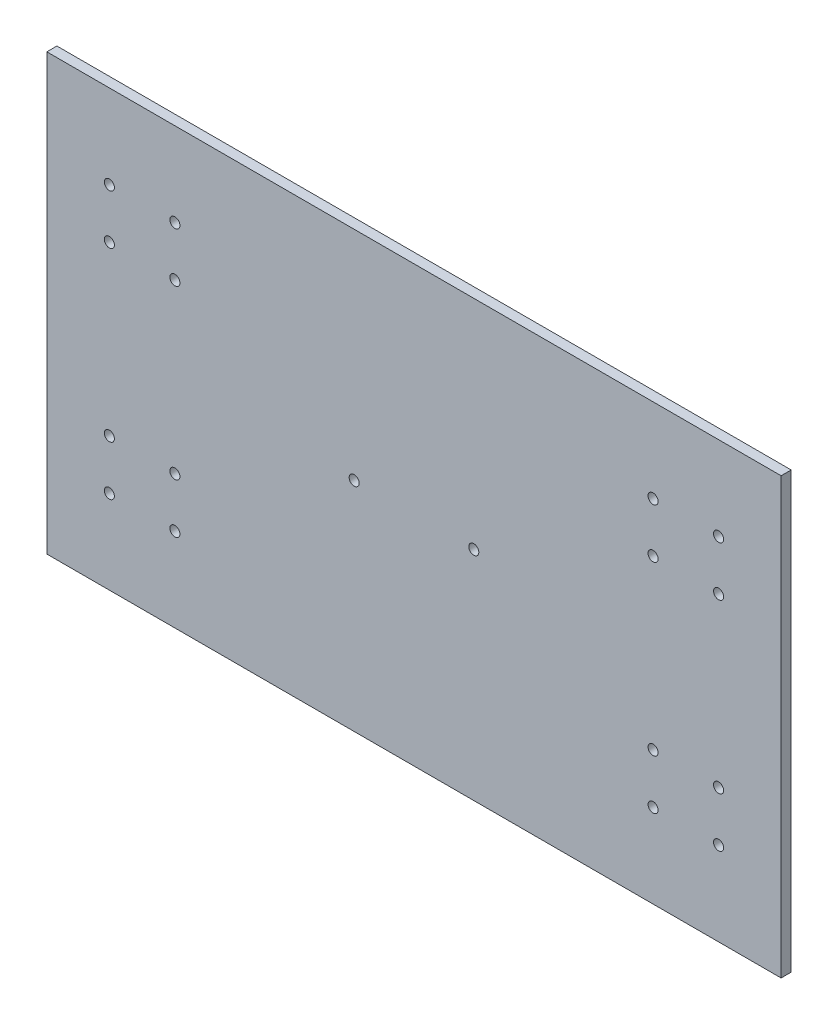
ISO-10303-21;
HEADER;
FILE_DESCRIPTION(('STEP AP214'),'2;1');
FILE_NAME('part.step','',(''),(''),'','','');
FILE_SCHEMA(('AUTOMOTIVE_DESIGN { 1 0 10303 214 1 1 1 1 }'));
ENDSEC;
DATA;
#1=APPLICATION_CONTEXT('core data for automotive mechanical design processes');
#2=APPLICATION_PROTOCOL_DEFINITION('international standard','automotive_design',2000,#1);
#3=PRODUCT_CONTEXT('',#1,'mechanical');
#4=PRODUCT('Part','Part','',(#3));
#5=PRODUCT_RELATED_PRODUCT_CATEGORY('part','',(#4));
#6=PRODUCT_DEFINITION_FORMATION('','',#4);
#7=PRODUCT_DEFINITION_CONTEXT('part definition',#1,'design');
#8=PRODUCT_DEFINITION('design','',#6,#7);
#9=PRODUCT_DEFINITION_SHAPE('','',#8);
#10=(LENGTH_UNIT() NAMED_UNIT(*) SI_UNIT(.MILLI.,.METRE.));
#11=(NAMED_UNIT(*) PLANE_ANGLE_UNIT() SI_UNIT($,.RADIAN.));
#12=(NAMED_UNIT(*) SI_UNIT($,.STERADIAN.) SOLID_ANGLE_UNIT());
#13=UNCERTAINTY_MEASURE_WITH_UNIT(LENGTH_MEASURE(1.E-05),#10,'distance_accuracy_value','');
#14=(GEOMETRIC_REPRESENTATION_CONTEXT(3) GLOBAL_UNCERTAINTY_ASSIGNED_CONTEXT((#13)) GLOBAL_UNIT_ASSIGNED_CONTEXT((#10,
#11,#12)) REPRESENTATION_CONTEXT('',''));
#15=CARTESIAN_POINT('',(0.,0.,0.));
#16=DIRECTION('',(0.,0.,1.));
#17=DIRECTION('',(1.,0.,0.));
#18=AXIS2_PLACEMENT_3D('',#15,#16,#17);
#19=CARTESIAN_POINT('',(157.05,80.0000000000001,3.7));
#20=DIRECTION('',(0.,0.,-1.));
#21=DIRECTION('',(-1.,0.,0.));
#22=AXIS2_PLACEMENT_3D('',#19,#20,#21);
#23=CYLINDRICAL_SURFACE('',#22,1.85);
#24=CARTESIAN_POINT('',(157.05,80.0000000000001,3.7));
#25=DIRECTION('',(0.,0.,1.));
#26=DIRECTION('',(1.,0.,0.));
#27=AXIS2_PLACEMENT_3D('',#24,#25,#26);
#28=CIRCLE('',#27,1.85);
#29=CARTESIAN_POINT('',(158.9,80.0000000000001,3.7));
#30=VERTEX_POINT('',#29);
#31=EDGE_CURVE('E202',#30,#30,#28,.F.);
#32=ORIENTED_EDGE('',*,*,#31,.F.);
#33=EDGE_LOOP('',(#32));
#34=FACE_BOUND('',#33,.T.);
#35=CARTESIAN_POINT('',(157.05,80.0000000000001,0.));
#36=DIRECTION('',(0.,0.,1.));
#37=DIRECTION('',(1.,0.,0.));
#38=AXIS2_PLACEMENT_3D('',#35,#36,#37);
#39=CIRCLE('',#38,1.85);
#40=CARTESIAN_POINT('',(158.9,80.0000000000001,0.));
#41=VERTEX_POINT('',#40);
#42=EDGE_CURVE('E264',#41,#41,#39,.F.);
#43=ORIENTED_EDGE('',*,*,#42,.T.);
#44=EDGE_LOOP('',(#43));
#45=FACE_BOUND('',#44,.T.);
#46=ADVANCED_FACE('F125',(#34,#45),#23,.F.);
#47=CARTESIAN_POINT('',(47.1,129.15,3.7));
#48=DIRECTION('',(0.,0.,-1.));
#49=DIRECTION('',(-1.,0.,0.));
#50=AXIS2_PLACEMENT_3D('',#47,#48,#49);
#51=CYLINDRICAL_SURFACE('',#50,1.85);
#52=CARTESIAN_POINT('',(47.1,129.15,3.7));
#53=DIRECTION('',(0.,0.,1.));
#54=DIRECTION('',(1.,0.,0.));
#55=AXIS2_PLACEMENT_3D('',#52,#53,#54);
#56=CIRCLE('',#55,1.85);
#57=CARTESIAN_POINT('',(48.95,129.15,3.7));
#58=VERTEX_POINT('',#57);
#59=EDGE_CURVE('E199',#58,#58,#56,.F.);
#60=ORIENTED_EDGE('',*,*,#59,.F.);
#61=EDGE_LOOP('',(#60));
#62=FACE_BOUND('',#61,.T.);
#63=CARTESIAN_POINT('',(47.1,129.15,0.));
#64=DIRECTION('',(0.,0.,1.));
#65=DIRECTION('',(1.,0.,0.));
#66=AXIS2_PLACEMENT_3D('',#63,#64,#65);
#67=CIRCLE('',#66,1.85);
#68=CARTESIAN_POINT('',(48.95,129.15,0.));
#69=VERTEX_POINT('',#68);
#70=EDGE_CURVE('E261',#69,#69,#67,.F.);
#71=ORIENTED_EDGE('',*,*,#70,.T.);
#72=EDGE_LOOP('',(#71));
#73=FACE_BOUND('',#72,.T.);
#74=ADVANCED_FACE('F326',(#62,#73),#51,.F.);
#75=CARTESIAN_POINT('',(23.,110.85,3.7));
#76=DIRECTION('',(0.,0.,-1.));
#77=DIRECTION('',(-1.,0.,0.));
#78=AXIS2_PLACEMENT_3D('',#75,#76,#77);
#79=CYLINDRICAL_SURFACE('',#78,1.85);
#80=CARTESIAN_POINT('',(23.,110.85,3.7));
#81=DIRECTION('',(0.,0.,1.));
#82=DIRECTION('',(1.,0.,0.));
#83=AXIS2_PLACEMENT_3D('',#80,#81,#82);
#84=CIRCLE('',#83,1.85);
#85=CARTESIAN_POINT('',(24.85,110.85,3.7));
#86=VERTEX_POINT('',#85);
#87=EDGE_CURVE('E196',#86,#86,#84,.F.);
#88=ORIENTED_EDGE('',*,*,#87,.F.);
#89=EDGE_LOOP('',(#88));
#90=FACE_BOUND('',#89,.T.);
#91=CARTESIAN_POINT('',(23.,110.85,0.));
#92=DIRECTION('',(0.,0.,1.));
#93=DIRECTION('',(1.,0.,0.));
#94=AXIS2_PLACEMENT_3D('',#91,#92,#93);
#95=CIRCLE('',#94,1.85);
#96=CARTESIAN_POINT('',(24.85,110.85,0.));
#97=VERTEX_POINT('',#96);
#98=EDGE_CURVE('E258',#97,#97,#95,.F.);
#99=ORIENTED_EDGE('',*,*,#98,.T.);
#100=EDGE_LOOP('',(#99));
#101=FACE_BOUND('',#100,.T.);
#102=ADVANCED_FACE('F332',(#90,#101),#79,.F.);
#103=CARTESIAN_POINT('',(247.1,30.85,3.7));
#104=DIRECTION('',(0.,0.,-1.));
#105=DIRECTION('',(-1.,0.,0.));
#106=AXIS2_PLACEMENT_3D('',#103,#104,#105);
#107=CYLINDRICAL_SURFACE('',#106,1.85);
#108=CARTESIAN_POINT('',(247.1,30.85,3.7));
#109=DIRECTION('',(0.,0.,1.));
#110=DIRECTION('',(1.,0.,0.));
#111=AXIS2_PLACEMENT_3D('',#108,#109,#110);
#112=CIRCLE('',#111,1.85);
#113=CARTESIAN_POINT('',(248.95,30.85,3.7));
#114=VERTEX_POINT('',#113);
#115=EDGE_CURVE('E193',#114,#114,#112,.F.);
#116=ORIENTED_EDGE('',*,*,#115,.F.);
#117=EDGE_LOOP('',(#116));
#118=FACE_BOUND('',#117,.T.);
#119=CARTESIAN_POINT('',(247.1,30.85,0.));
#120=DIRECTION('',(0.,0.,1.));
#121=DIRECTION('',(1.,0.,0.));
#122=AXIS2_PLACEMENT_3D('',#119,#120,#121);
#123=CIRCLE('',#122,1.85);
#124=CARTESIAN_POINT('',(248.95,30.85,0.));
#125=VERTEX_POINT('',#124);
#126=EDGE_CURVE('E255',#125,#125,#123,.F.);
#127=ORIENTED_EDGE('',*,*,#126,.T.);
#128=EDGE_LOOP('',(#127));
#129=FACE_BOUND('',#128,.T.);
#130=ADVANCED_FACE('F339',(#118,#129),#107,.F.);
#131=CARTESIAN_POINT('',(223.,49.15,3.7));
#132=DIRECTION('',(0.,0.,-1.));
#133=DIRECTION('',(-1.,0.,0.));
#134=AXIS2_PLACEMENT_3D('',#131,#132,#133);
#135=CYLINDRICAL_SURFACE('',#134,1.85);
#136=CARTESIAN_POINT('',(223.,49.15,3.7));
#137=DIRECTION('',(0.,0.,1.));
#138=DIRECTION('',(1.,0.,0.));
#139=AXIS2_PLACEMENT_3D('',#136,#137,#138);
#140=CIRCLE('',#139,1.85);
#141=CARTESIAN_POINT('',(224.85,49.15,3.7));
#142=VERTEX_POINT('',#141);
#143=EDGE_CURVE('E187',#142,#142,#140,.F.);
#144=ORIENTED_EDGE('',*,*,#143,.F.);
#145=EDGE_LOOP('',(#144));
#146=FACE_BOUND('',#145,.T.);
#147=CARTESIAN_POINT('',(223.,49.15,0.));
#148=DIRECTION('',(0.,0.,1.));
#149=DIRECTION('',(1.,0.,0.));
#150=AXIS2_PLACEMENT_3D('',#147,#148,#149);
#151=CIRCLE('',#150,1.85);
#152=CARTESIAN_POINT('',(224.85,49.15,0.));
#153=VERTEX_POINT('',#152);
#154=EDGE_CURVE('E252',#153,#153,#151,.F.);
#155=ORIENTED_EDGE('',*,*,#154,.T.);
#156=EDGE_LOOP('',(#155));
#157=FACE_BOUND('',#156,.T.);
#158=ADVANCED_FACE('F343',(#146,#157),#135,.F.);
#159=CARTESIAN_POINT('',(0.,0.,3.7));
#160=DIRECTION('',(1.,0.,0.));
#161=DIRECTION('',(0.,1.,0.));
#162=AXIS2_PLACEMENT_3D('',#159,#160,#161);
#163=PLANE('',#162);
#164=DIRECTION('',(0.,-1.,0.));
#165=VECTOR('',#164,1.);
#166=CARTESIAN_POINT('',(0.,0.,0.));
#167=LINE('',#166,#165);
#168=CARTESIAN_POINT('',(0.,160.,0.));
#169=VERTEX_POINT('',#168);
#170=CARTESIAN_POINT('',(0.,0.,0.));
#171=VERTEX_POINT('',#170);
#172=EDGE_CURVE('E181',#169,#171,#167,.T.);
#173=ORIENTED_EDGE('',*,*,#172,.T.);
#174=DIRECTION('',(0.,0.,-1.));
#175=VECTOR('',#174,1.);
#176=CARTESIAN_POINT('',(0.,0.,3.7));
#177=LINE('',#176,#175);
#178=CARTESIAN_POINT('',(0.,0.,3.7));
#179=VERTEX_POINT('',#178);
#180=EDGE_CURVE('E134',#179,#171,#177,.T.);
#181=ORIENTED_EDGE('',*,*,#180,.F.);
#182=DIRECTION('',(0.,-1.,0.));
#183=VECTOR('',#182,1.);
#184=CARTESIAN_POINT('',(0.,0.,3.7));
#185=LINE('',#184,#183);
#186=CARTESIAN_POINT('',(0.,160.,3.7));
#187=VERTEX_POINT('',#186);
#188=EDGE_CURVE('E167',#187,#179,#185,.T.);
#189=ORIENTED_EDGE('',*,*,#188,.F.);
#190=DIRECTION('',(0.,0.,-1.));
#191=VECTOR('',#190,1.);
#192=CARTESIAN_POINT('',(0.,160.,3.7));
#193=LINE('',#192,#191);
#194=EDGE_CURVE('E12',#187,#169,#193,.T.);
#195=ORIENTED_EDGE('',*,*,#194,.T.);
#196=EDGE_LOOP('',(#173,#181,#189,#195));
#197=FACE_BOUND('',#196,.T.);
#198=ADVANCED_FACE('F180',(#197),#163,.F.);
#199=CARTESIAN_POINT('',(0.,0.,3.7));
#200=DIRECTION('',(0.,-1.,0.));
#201=DIRECTION('',(1.,0.,0.));
#202=AXIS2_PLACEMENT_3D('',#199,#200,#201);
#203=PLANE('',#202);
#204=DIRECTION('',(-1.,0.,0.));
#205=VECTOR('',#204,1.);
#206=CARTESIAN_POINT('',(0.,0.,0.));
#207=LINE('',#206,#205);
#208=CARTESIAN_POINT('',(270.1,0.,0.));
#209=VERTEX_POINT('',#208);
#210=EDGE_CURVE('E247',#209,#171,#207,.T.);
#211=ORIENTED_EDGE('',*,*,#210,.F.);
#212=DIRECTION('',(0.,0.,-1.));
#213=VECTOR('',#212,1.);
#214=CARTESIAN_POINT('',(270.1,0.,3.7));
#215=LINE('',#214,#213);
#216=CARTESIAN_POINT('',(270.1,0.,3.7));
#217=VERTEX_POINT('',#216);
#218=EDGE_CURVE('E156',#217,#209,#215,.T.);
#219=ORIENTED_EDGE('',*,*,#218,.F.);
#220=DIRECTION('',(-1.,0.,0.));
#221=VECTOR('',#220,1.);
#222=CARTESIAN_POINT('',(0.,0.,3.7));
#223=LINE('',#222,#221);
#224=EDGE_CURVE('E175',#217,#179,#223,.T.);
#225=ORIENTED_EDGE('',*,*,#224,.T.);
#226=ORIENTED_EDGE('',*,*,#180,.T.);
#227=EDGE_LOOP('',(#211,#219,#225,#226));
#228=FACE_BOUND('',#227,.T.);
#229=ADVANCED_FACE('F184',(#228),#203,.T.);
#230=CARTESIAN_POINT('',(270.1,0.,3.7));
#231=DIRECTION('',(1.,0.,0.));
#232=DIRECTION('',(0.,0.,-1.));
#233=AXIS2_PLACEMENT_3D('',#230,#231,#232);
#234=PLANE('',#233);
#235=DIRECTION('',(0.,-1.,0.));
#236=VECTOR('',#235,1.);
#237=CARTESIAN_POINT('',(270.1,0.,0.));
#238=LINE('',#237,#236);
#239=CARTESIAN_POINT('',(270.1,160.,0.));
#240=VERTEX_POINT('',#239);
#241=EDGE_CURVE('E249',#240,#209,#238,.T.);
#242=ORIENTED_EDGE('',*,*,#241,.F.);
#243=DIRECTION('',(0.,0.,-1.));
#244=VECTOR('',#243,1.);
#245=CARTESIAN_POINT('',(270.1,160.,3.7));
#246=LINE('',#245,#244);
#247=CARTESIAN_POINT('',(270.1,160.,3.7));
#248=VERTEX_POINT('',#247);
#249=EDGE_CURVE('E142',#248,#240,#246,.T.);
#250=ORIENTED_EDGE('',*,*,#249,.F.);
#251=DIRECTION('',(0.,-1.,0.));
#252=VECTOR('',#251,1.);
#253=CARTESIAN_POINT('',(270.1,0.,3.7));
#254=LINE('',#253,#252);
#255=EDGE_CURVE('E185',#248,#217,#254,.T.);
#256=ORIENTED_EDGE('',*,*,#255,.T.);
#257=ORIENTED_EDGE('',*,*,#218,.T.);
#258=EDGE_LOOP('',(#242,#250,#256,#257));
#259=FACE_BOUND('',#258,.T.);
#260=ADVANCED_FACE('F348',(#259),#234,.T.);
#261=CARTESIAN_POINT('',(0.,160.,3.7));
#262=DIRECTION('',(0.,-1.,0.));
#263=DIRECTION('',(1.,0.,0.));
#264=AXIS2_PLACEMENT_3D('',#261,#262,#263);
#265=PLANE('',#264);
#266=DIRECTION('',(-1.,0.,0.));
#267=VECTOR('',#266,1.);
#268=CARTESIAN_POINT('',(0.,160.,0.));
#269=LINE('',#268,#267);
#270=EDGE_CURVE('E244',#240,#169,#269,.T.);
#271=ORIENTED_EDGE('',*,*,#270,.T.);
#272=ORIENTED_EDGE('',*,*,#194,.F.);
#273=DIRECTION('',(-1.,0.,0.));
#274=VECTOR('',#273,1.);
#275=CARTESIAN_POINT('',(0.,160.,3.7));
#276=LINE('',#275,#274);
#277=EDGE_CURVE('E176',#248,#187,#276,.T.);
#278=ORIENTED_EDGE('',*,*,#277,.F.);
#279=ORIENTED_EDGE('',*,*,#249,.T.);
#280=EDGE_LOOP('',(#271,#272,#278,#279));
#281=FACE_BOUND('',#280,.T.);
#282=ADVANCED_FACE('F351',(#281),#265,.F.);
#283=CARTESIAN_POINT('',(23.,49.15,3.7));
#284=DIRECTION('',(0.,0.,-1.));
#285=DIRECTION('',(-1.,0.,0.));
#286=AXIS2_PLACEMENT_3D('',#283,#284,#285);
#287=CYLINDRICAL_SURFACE('',#286,1.85);
#288=CARTESIAN_POINT('',(23.,49.15,3.7));
#289=DIRECTION('',(0.,0.,1.));
#290=DIRECTION('',(1.,0.,0.));
#291=AXIS2_PLACEMENT_3D('',#288,#289,#290);
#292=CIRCLE('',#291,1.85);
#293=CARTESIAN_POINT('',(24.85,49.15,3.7));
#294=VERTEX_POINT('',#293);
#295=EDGE_CURVE('E309',#294,#294,#292,.T.);
#296=ORIENTED_EDGE('',*,*,#295,.T.);
#297=EDGE_LOOP('',(#296));
#298=FACE_BOUND('',#297,.T.);
#299=CARTESIAN_POINT('',(23.,49.15,0.));
#300=DIRECTION('',(0.,0.,1.));
#301=DIRECTION('',(1.,0.,0.));
#302=AXIS2_PLACEMENT_3D('',#299,#300,#301);
#303=CIRCLE('',#302,1.85);
#304=CARTESIAN_POINT('',(24.85,49.15,0.));
#305=VERTEX_POINT('',#304);
#306=EDGE_CURVE('E241',#305,#305,#303,.T.);
#307=ORIENTED_EDGE('',*,*,#306,.F.);
#308=EDGE_LOOP('',(#307));
#309=FACE_BOUND('',#308,.T.);
#310=ADVANCED_FACE('F313',(#298,#309),#287,.F.);
#311=CARTESIAN_POINT('',(47.1,49.15,3.7));
#312=DIRECTION('',(0.,0.,-1.));
#313=DIRECTION('',(-1.,0.,0.));
#314=AXIS2_PLACEMENT_3D('',#311,#312,#313);
#315=CYLINDRICAL_SURFACE('',#314,1.85);
#316=CARTESIAN_POINT('',(47.1,49.15,3.7));
#317=DIRECTION('',(0.,0.,1.));
#318=DIRECTION('',(1.,0.,0.));
#319=AXIS2_PLACEMENT_3D('',#316,#317,#318);
#320=CIRCLE('',#319,1.85);
#321=CARTESIAN_POINT('',(48.95,49.15,3.7));
#322=VERTEX_POINT('',#321);
#323=EDGE_CURVE('E306',#322,#322,#320,.T.);
#324=ORIENTED_EDGE('',*,*,#323,.T.);
#325=EDGE_LOOP('',(#324));
#326=FACE_BOUND('',#325,.T.);
#327=CARTESIAN_POINT('',(47.1,49.15,0.));
#328=DIRECTION('',(0.,0.,1.));
#329=DIRECTION('',(1.,0.,0.));
#330=AXIS2_PLACEMENT_3D('',#327,#328,#329);
#331=CIRCLE('',#330,1.85);
#332=CARTESIAN_POINT('',(48.95,49.15,0.));
#333=VERTEX_POINT('',#332);
#334=EDGE_CURVE('E238',#333,#333,#331,.T.);
#335=ORIENTED_EDGE('',*,*,#334,.F.);
#336=EDGE_LOOP('',(#335));
#337=FACE_BOUND('',#336,.T.);
#338=ADVANCED_FACE('F360',(#326,#337),#315,.F.);
#339=CARTESIAN_POINT('',(23.,30.85,3.7));
#340=DIRECTION('',(0.,0.,-1.));
#341=DIRECTION('',(-1.,0.,0.));
#342=AXIS2_PLACEMENT_3D('',#339,#340,#341);
#343=CYLINDRICAL_SURFACE('',#342,1.85);
#344=CARTESIAN_POINT('',(23.,30.85,3.7));
#345=DIRECTION('',(0.,0.,1.));
#346=DIRECTION('',(1.,0.,0.));
#347=AXIS2_PLACEMENT_3D('',#344,#345,#346);
#348=CIRCLE('',#347,1.85);
#349=CARTESIAN_POINT('',(24.85,30.85,3.7));
#350=VERTEX_POINT('',#349);
#351=EDGE_CURVE('E303',#350,#350,#348,.T.);
#352=ORIENTED_EDGE('',*,*,#351,.T.);
#353=EDGE_LOOP('',(#352));
#354=FACE_BOUND('',#353,.T.);
#355=CARTESIAN_POINT('',(23.,30.85,0.));
#356=DIRECTION('',(0.,0.,1.));
#357=DIRECTION('',(1.,0.,0.));
#358=AXIS2_PLACEMENT_3D('',#355,#356,#357);
#359=CIRCLE('',#358,1.85);
#360=CARTESIAN_POINT('',(24.85,30.85,0.));
#361=VERTEX_POINT('',#360);
#362=EDGE_CURVE('E235',#361,#361,#359,.T.);
#363=ORIENTED_EDGE('',*,*,#362,.F.);
#364=EDGE_LOOP('',(#363));
#365=FACE_BOUND('',#364,.T.);
#366=ADVANCED_FACE('F363',(#354,#365),#343,.F.);
#367=CARTESIAN_POINT('',(47.1,30.85,3.7));
#368=DIRECTION('',(0.,0.,-1.));
#369=DIRECTION('',(-1.,0.,0.));
#370=AXIS2_PLACEMENT_3D('',#367,#368,#369);
#371=CYLINDRICAL_SURFACE('',#370,1.85);
#372=CARTESIAN_POINT('',(47.1,30.85,3.7));
#373=DIRECTION('',(0.,0.,1.));
#374=DIRECTION('',(1.,0.,0.));
#375=AXIS2_PLACEMENT_3D('',#372,#373,#374);
#376=CIRCLE('',#375,1.85);
#377=CARTESIAN_POINT('',(48.95,30.85,3.7));
#378=VERTEX_POINT('',#377);
#379=EDGE_CURVE('E300',#378,#378,#376,.T.);
#380=ORIENTED_EDGE('',*,*,#379,.T.);
#381=EDGE_LOOP('',(#380));
#382=FACE_BOUND('',#381,.T.);
#383=CARTESIAN_POINT('',(47.1,30.85,0.));
#384=DIRECTION('',(0.,0.,1.));
#385=DIRECTION('',(1.,0.,0.));
#386=AXIS2_PLACEMENT_3D('',#383,#384,#385);
#387=CIRCLE('',#386,1.85);
#388=CARTESIAN_POINT('',(48.95,30.85,0.));
#389=VERTEX_POINT('',#388);
#390=EDGE_CURVE('E232',#389,#389,#387,.T.);
#391=ORIENTED_EDGE('',*,*,#390,.F.);
#392=EDGE_LOOP('',(#391));
#393=FACE_BOUND('',#392,.T.);
#394=ADVANCED_FACE('F367',(#382,#393),#371,.F.);
#395=CARTESIAN_POINT('',(223.,30.85,3.7));
#396=DIRECTION('',(0.,0.,-1.));
#397=DIRECTION('',(-1.,0.,0.));
#398=AXIS2_PLACEMENT_3D('',#395,#396,#397);
#399=CYLINDRICAL_SURFACE('',#398,1.85);
#400=CARTESIAN_POINT('',(223.,30.85,3.7));
#401=DIRECTION('',(0.,0.,1.));
#402=DIRECTION('',(1.,0.,0.));
#403=AXIS2_PLACEMENT_3D('',#400,#401,#402);
#404=CIRCLE('',#403,1.85);
#405=CARTESIAN_POINT('',(224.85,30.85,3.7));
#406=VERTEX_POINT('',#405);
#407=EDGE_CURVE('E297',#406,#406,#404,.F.);
#408=ORIENTED_EDGE('',*,*,#407,.F.);
#409=EDGE_LOOP('',(#408));
#410=FACE_BOUND('',#409,.T.);
#411=CARTESIAN_POINT('',(223.,30.85,0.));
#412=DIRECTION('',(0.,0.,1.));
#413=DIRECTION('',(1.,0.,0.));
#414=AXIS2_PLACEMENT_3D('',#411,#412,#413);
#415=CIRCLE('',#414,1.85);
#416=CARTESIAN_POINT('',(224.85,30.85,0.));
#417=VERTEX_POINT('',#416);
#418=EDGE_CURVE('E229',#417,#417,#415,.F.);
#419=ORIENTED_EDGE('',*,*,#418,.T.);
#420=EDGE_LOOP('',(#419));
#421=FACE_BOUND('',#420,.T.);
#422=ADVANCED_FACE('F371',(#410,#421),#399,.F.);
#423=CARTESIAN_POINT('',(247.1,49.15,3.7));
#424=DIRECTION('',(0.,0.,-1.));
#425=DIRECTION('',(-1.,0.,0.));
#426=AXIS2_PLACEMENT_3D('',#423,#424,#425);
#427=CYLINDRICAL_SURFACE('',#426,1.85);
#428=CARTESIAN_POINT('',(247.1,49.15,3.7));
#429=DIRECTION('',(0.,0.,1.));
#430=DIRECTION('',(1.,0.,0.));
#431=AXIS2_PLACEMENT_3D('',#428,#429,#430);
#432=CIRCLE('',#431,1.85);
#433=CARTESIAN_POINT('',(248.95,49.15,3.7));
#434=VERTEX_POINT('',#433);
#435=EDGE_CURVE('E294',#434,#434,#432,.F.);
#436=ORIENTED_EDGE('',*,*,#435,.F.);
#437=EDGE_LOOP('',(#436));
#438=FACE_BOUND('',#437,.T.);
#439=CARTESIAN_POINT('',(247.1,49.15,0.));
#440=DIRECTION('',(0.,0.,1.));
#441=DIRECTION('',(1.,0.,0.));
#442=AXIS2_PLACEMENT_3D('',#439,#440,#441);
#443=CIRCLE('',#442,1.85);
#444=CARTESIAN_POINT('',(248.95,49.15,0.));
#445=VERTEX_POINT('',#444);
#446=EDGE_CURVE('E226',#445,#445,#443,.F.);
#447=ORIENTED_EDGE('',*,*,#446,.T.);
#448=EDGE_LOOP('',(#447));
#449=FACE_BOUND('',#448,.T.);
#450=ADVANCED_FACE('F375',(#438,#449),#427,.F.);
#451=CARTESIAN_POINT('',(23.,129.15,3.7));
#452=DIRECTION('',(0.,0.,-1.));
#453=DIRECTION('',(-1.,0.,0.));
#454=AXIS2_PLACEMENT_3D('',#451,#452,#453);
#455=CYLINDRICAL_SURFACE('',#454,1.85);
#456=CARTESIAN_POINT('',(23.,129.15,3.7));
#457=DIRECTION('',(0.,0.,1.));
#458=DIRECTION('',(1.,0.,0.));
#459=AXIS2_PLACEMENT_3D('',#456,#457,#458);
#460=CIRCLE('',#459,1.85);
#461=CARTESIAN_POINT('',(24.85,129.15,3.7));
#462=VERTEX_POINT('',#461);
#463=EDGE_CURVE('E291',#462,#462,#460,.F.);
#464=ORIENTED_EDGE('',*,*,#463,.F.);
#465=EDGE_LOOP('',(#464));
#466=FACE_BOUND('',#465,.T.);
#467=CARTESIAN_POINT('',(23.,129.15,0.));
#468=DIRECTION('',(0.,0.,1.));
#469=DIRECTION('',(1.,0.,0.));
#470=AXIS2_PLACEMENT_3D('',#467,#468,#469);
#471=CIRCLE('',#470,1.85);
#472=CARTESIAN_POINT('',(24.85,129.15,0.));
#473=VERTEX_POINT('',#472);
#474=EDGE_CURVE('E223',#473,#473,#471,.F.);
#475=ORIENTED_EDGE('',*,*,#474,.T.);
#476=EDGE_LOOP('',(#475));
#477=FACE_BOUND('',#476,.T.);
#478=ADVANCED_FACE('F379',(#466,#477),#455,.F.);
#479=CARTESIAN_POINT('',(47.1,110.85,3.7));
#480=DIRECTION('',(0.,0.,-1.));
#481=DIRECTION('',(-1.,0.,0.));
#482=AXIS2_PLACEMENT_3D('',#479,#480,#481);
#483=CYLINDRICAL_SURFACE('',#482,1.85);
#484=CARTESIAN_POINT('',(47.1,110.85,3.7));
#485=DIRECTION('',(0.,0.,1.));
#486=DIRECTION('',(1.,0.,0.));
#487=AXIS2_PLACEMENT_3D('',#484,#485,#486);
#488=CIRCLE('',#487,1.85);
#489=CARTESIAN_POINT('',(48.95,110.85,3.7));
#490=VERTEX_POINT('',#489);
#491=EDGE_CURVE('E288',#490,#490,#488,.F.);
#492=ORIENTED_EDGE('',*,*,#491,.F.);
#493=EDGE_LOOP('',(#492));
#494=FACE_BOUND('',#493,.T.);
#495=CARTESIAN_POINT('',(47.1,110.85,0.));
#496=DIRECTION('',(0.,0.,1.));
#497=DIRECTION('',(1.,0.,0.));
#498=AXIS2_PLACEMENT_3D('',#495,#496,#497);
#499=CIRCLE('',#498,1.85);
#500=CARTESIAN_POINT('',(48.95,110.85,0.));
#501=VERTEX_POINT('',#500);
#502=EDGE_CURVE('E220',#501,#501,#499,.F.);
#503=ORIENTED_EDGE('',*,*,#502,.T.);
#504=EDGE_LOOP('',(#503));
#505=FACE_BOUND('',#504,.T.);
#506=ADVANCED_FACE('F383',(#494,#505),#483,.F.);
#507=CARTESIAN_POINT('',(223.,110.85,3.7));
#508=DIRECTION('',(0.,0.,-1.));
#509=DIRECTION('',(-1.,0.,0.));
#510=AXIS2_PLACEMENT_3D('',#507,#508,#509);
#511=CYLINDRICAL_SURFACE('',#510,1.85);
#512=CARTESIAN_POINT('',(223.,110.85,3.7));
#513=DIRECTION('',(0.,0.,1.));
#514=DIRECTION('',(1.,0.,0.));
#515=AXIS2_PLACEMENT_3D('',#512,#513,#514);
#516=CIRCLE('',#515,1.85);
#517=CARTESIAN_POINT('',(224.85,110.85,3.7));
#518=VERTEX_POINT('',#517);
#519=EDGE_CURVE('E285',#518,#518,#516,.T.);
#520=ORIENTED_EDGE('',*,*,#519,.T.);
#521=EDGE_LOOP('',(#520));
#522=FACE_BOUND('',#521,.T.);
#523=CARTESIAN_POINT('',(223.,110.85,0.));
#524=DIRECTION('',(0.,0.,1.));
#525=DIRECTION('',(1.,0.,0.));
#526=AXIS2_PLACEMENT_3D('',#523,#524,#525);
#527=CIRCLE('',#526,1.85);
#528=CARTESIAN_POINT('',(224.85,110.85,0.));
#529=VERTEX_POINT('',#528);
#530=EDGE_CURVE('E217',#529,#529,#527,.T.);
#531=ORIENTED_EDGE('',*,*,#530,.F.);
#532=EDGE_LOOP('',(#531));
#533=FACE_BOUND('',#532,.T.);
#534=ADVANCED_FACE('F387',(#522,#533),#511,.F.);
#535=CARTESIAN_POINT('',(223.,129.15,3.7));
#536=DIRECTION('',(0.,0.,-1.));
#537=DIRECTION('',(-1.,0.,0.));
#538=AXIS2_PLACEMENT_3D('',#535,#536,#537);
#539=CYLINDRICAL_SURFACE('',#538,1.85);
#540=CARTESIAN_POINT('',(223.,129.15,3.7));
#541=DIRECTION('',(0.,0.,1.));
#542=DIRECTION('',(1.,0.,0.));
#543=AXIS2_PLACEMENT_3D('',#540,#541,#542);
#544=CIRCLE('',#543,1.85);
#545=CARTESIAN_POINT('',(224.85,129.15,3.7));
#546=VERTEX_POINT('',#545);
#547=EDGE_CURVE('E282',#546,#546,#544,.T.);
#548=ORIENTED_EDGE('',*,*,#547,.T.);
#549=EDGE_LOOP('',(#548));
#550=FACE_BOUND('',#549,.T.);
#551=CARTESIAN_POINT('',(223.,129.15,0.));
#552=DIRECTION('',(0.,0.,1.));
#553=DIRECTION('',(1.,0.,0.));
#554=AXIS2_PLACEMENT_3D('',#551,#552,#553);
#555=CIRCLE('',#554,1.85);
#556=CARTESIAN_POINT('',(224.85,129.15,0.));
#557=VERTEX_POINT('',#556);
#558=EDGE_CURVE('E214',#557,#557,#555,.T.);
#559=ORIENTED_EDGE('',*,*,#558,.F.);
#560=EDGE_LOOP('',(#559));
#561=FACE_BOUND('',#560,.T.);
#562=ADVANCED_FACE('F391',(#550,#561),#539,.F.);
#563=CARTESIAN_POINT('',(247.1,129.15,3.7));
#564=DIRECTION('',(0.,0.,-1.));
#565=DIRECTION('',(-1.,0.,0.));
#566=AXIS2_PLACEMENT_3D('',#563,#564,#565);
#567=CYLINDRICAL_SURFACE('',#566,1.85);
#568=CARTESIAN_POINT('',(247.1,129.15,3.7));
#569=DIRECTION('',(0.,0.,1.));
#570=DIRECTION('',(1.,0.,0.));
#571=AXIS2_PLACEMENT_3D('',#568,#569,#570);
#572=CIRCLE('',#571,1.85);
#573=CARTESIAN_POINT('',(248.95,129.15,3.7));
#574=VERTEX_POINT('',#573);
#575=EDGE_CURVE('E277',#574,#574,#572,.T.);
#576=ORIENTED_EDGE('',*,*,#575,.T.);
#577=EDGE_LOOP('',(#576));
#578=FACE_BOUND('',#577,.T.);
#579=CARTESIAN_POINT('',(247.1,129.15,0.));
#580=DIRECTION('',(0.,0.,1.));
#581=DIRECTION('',(1.,0.,0.));
#582=AXIS2_PLACEMENT_3D('',#579,#580,#581);
#583=CIRCLE('',#582,1.85);
#584=CARTESIAN_POINT('',(248.95,129.15,0.));
#585=VERTEX_POINT('',#584);
#586=EDGE_CURVE('E211',#585,#585,#583,.T.);
#587=ORIENTED_EDGE('',*,*,#586,.F.);
#588=EDGE_LOOP('',(#587));
#589=FACE_BOUND('',#588,.T.);
#590=ADVANCED_FACE('F395',(#578,#589),#567,.F.);
#591=CARTESIAN_POINT('',(247.1,110.85,3.7));
#592=DIRECTION('',(0.,0.,-1.));
#593=DIRECTION('',(-1.,0.,0.));
#594=AXIS2_PLACEMENT_3D('',#591,#592,#593);
#595=CYLINDRICAL_SURFACE('',#594,1.85);
#596=CARTESIAN_POINT('',(247.1,110.85,3.7));
#597=DIRECTION('',(0.,0.,1.));
#598=DIRECTION('',(1.,0.,0.));
#599=AXIS2_PLACEMENT_3D('',#596,#597,#598);
#600=CIRCLE('',#599,1.85);
#601=CARTESIAN_POINT('',(248.95,110.85,3.7));
#602=VERTEX_POINT('',#601);
#603=EDGE_CURVE('E272',#602,#602,#600,.T.);
#604=ORIENTED_EDGE('',*,*,#603,.T.);
#605=EDGE_LOOP('',(#604));
#606=FACE_BOUND('',#605,.T.);
#607=CARTESIAN_POINT('',(247.1,110.85,0.));
#608=DIRECTION('',(0.,0.,1.));
#609=DIRECTION('',(1.,0.,0.));
#610=AXIS2_PLACEMENT_3D('',#607,#608,#609);
#611=CIRCLE('',#610,1.85);
#612=CARTESIAN_POINT('',(248.95,110.85,0.));
#613=VERTEX_POINT('',#612);
#614=EDGE_CURVE('E208',#613,#613,#611,.T.);
#615=ORIENTED_EDGE('',*,*,#614,.F.);
#616=EDGE_LOOP('',(#615));
#617=FACE_BOUND('',#616,.T.);
#618=ADVANCED_FACE('F398',(#606,#617),#595,.F.);
#619=CARTESIAN_POINT('',(113.05,80.,3.7));
#620=DIRECTION('',(0.,0.,-1.));
#621=DIRECTION('',(-1.,0.,0.));
#622=AXIS2_PLACEMENT_3D('',#619,#620,#621);
#623=CYLINDRICAL_SURFACE('',#622,1.85000000000001);
#624=CARTESIAN_POINT('',(113.05,80.,3.7));
#625=DIRECTION('',(0.,0.,1.));
#626=DIRECTION('',(1.,0.,0.));
#627=AXIS2_PLACEMENT_3D('',#624,#625,#626);
#628=CIRCLE('',#627,1.85000000000001);
#629=CARTESIAN_POINT('',(114.9,80.,3.7));
#630=VERTEX_POINT('',#629);
#631=EDGE_CURVE('E267',#630,#630,#628,.F.);
#632=ORIENTED_EDGE('',*,*,#631,.F.);
#633=EDGE_LOOP('',(#632));
#634=FACE_BOUND('',#633,.T.);
#635=CARTESIAN_POINT('',(113.05,80.,0.));
#636=DIRECTION('',(0.,0.,1.));
#637=DIRECTION('',(1.,0.,0.));
#638=AXIS2_PLACEMENT_3D('',#635,#636,#637);
#639=CIRCLE('',#638,1.85000000000001);
#640=CARTESIAN_POINT('',(114.9,80.,0.));
#641=VERTEX_POINT('',#640);
#642=EDGE_CURVE('E205',#641,#641,#639,.F.);
#643=ORIENTED_EDGE('',*,*,#642,.T.);
#644=EDGE_LOOP('',(#643));
#645=FACE_BOUND('',#644,.T.);
#646=ADVANCED_FACE('F127',(#634,#645),#623,.F.);
#647=CARTESIAN_POINT('',(0.,0.,0.));
#648=DIRECTION('',(0.,0.,1.));
#649=DIRECTION('',(1.,0.,0.));
#650=AXIS2_PLACEMENT_3D('',#647,#648,#649);
#651=PLANE('',#650);
#652=ORIENTED_EDGE('',*,*,#642,.F.);
#653=EDGE_LOOP('',(#652));
#654=FACE_BOUND('',#653,.T.);
#655=ORIENTED_EDGE('',*,*,#614,.T.);
#656=EDGE_LOOP('',(#655));
#657=FACE_BOUND('',#656,.T.);
#658=ORIENTED_EDGE('',*,*,#586,.T.);
#659=EDGE_LOOP('',(#658));
#660=FACE_BOUND('',#659,.T.);
#661=ORIENTED_EDGE('',*,*,#558,.T.);
#662=EDGE_LOOP('',(#661));
#663=FACE_BOUND('',#662,.T.);
#664=ORIENTED_EDGE('',*,*,#530,.T.);
#665=EDGE_LOOP('',(#664));
#666=FACE_BOUND('',#665,.T.);
#667=ORIENTED_EDGE('',*,*,#502,.F.);
#668=EDGE_LOOP('',(#667));
#669=FACE_BOUND('',#668,.T.);
#670=ORIENTED_EDGE('',*,*,#474,.F.);
#671=EDGE_LOOP('',(#670));
#672=FACE_BOUND('',#671,.T.);
#673=ORIENTED_EDGE('',*,*,#446,.F.);
#674=EDGE_LOOP('',(#673));
#675=FACE_BOUND('',#674,.T.);
#676=ORIENTED_EDGE('',*,*,#418,.F.);
#677=EDGE_LOOP('',(#676));
#678=FACE_BOUND('',#677,.T.);
#679=ORIENTED_EDGE('',*,*,#390,.T.);
#680=EDGE_LOOP('',(#679));
#681=FACE_BOUND('',#680,.T.);
#682=ORIENTED_EDGE('',*,*,#362,.T.);
#683=EDGE_LOOP('',(#682));
#684=FACE_BOUND('',#683,.T.);
#685=ORIENTED_EDGE('',*,*,#334,.T.);
#686=EDGE_LOOP('',(#685));
#687=FACE_BOUND('',#686,.T.);
#688=ORIENTED_EDGE('',*,*,#306,.T.);
#689=EDGE_LOOP('',(#688));
#690=FACE_BOUND('',#689,.T.);
#691=ORIENTED_EDGE('',*,*,#270,.F.);
#692=ORIENTED_EDGE('',*,*,#241,.T.);
#693=ORIENTED_EDGE('',*,*,#210,.T.);
#694=ORIENTED_EDGE('',*,*,#172,.F.);
#695=EDGE_LOOP('',(#691,#692,#693,#694));
#696=FACE_BOUND('',#695,.T.);
#697=ORIENTED_EDGE('',*,*,#154,.F.);
#698=EDGE_LOOP('',(#697));
#699=FACE_BOUND('',#698,.T.);
#700=ORIENTED_EDGE('',*,*,#126,.F.);
#701=EDGE_LOOP('',(#700));
#702=FACE_BOUND('',#701,.T.);
#703=ORIENTED_EDGE('',*,*,#98,.F.);
#704=EDGE_LOOP('',(#703));
#705=FACE_BOUND('',#704,.T.);
#706=ORIENTED_EDGE('',*,*,#70,.F.);
#707=EDGE_LOOP('',(#706));
#708=FACE_BOUND('',#707,.T.);
#709=ORIENTED_EDGE('',*,*,#42,.F.);
#710=EDGE_LOOP('',(#709));
#711=FACE_BOUND('',#710,.T.);
#712=ADVANCED_FACE('F317',(#654,#657,#660,#663,#666,#669,#672,#675,#678,#681,#684,#687,#690,
#696,#699,#702,#705,#708,#711),#651,.F.);
#713=CARTESIAN_POINT('',(0.,0.,3.7));
#714=DIRECTION('',(0.,0.,1.));
#715=DIRECTION('',(1.,0.,0.));
#716=AXIS2_PLACEMENT_3D('',#713,#714,#715);
#717=PLANE('',#716);
#718=ORIENTED_EDGE('',*,*,#631,.T.);
#719=EDGE_LOOP('',(#718));
#720=FACE_BOUND('',#719,.T.);
#721=ORIENTED_EDGE('',*,*,#603,.F.);
#722=EDGE_LOOP('',(#721));
#723=FACE_BOUND('',#722,.T.);
#724=ORIENTED_EDGE('',*,*,#575,.F.);
#725=EDGE_LOOP('',(#724));
#726=FACE_BOUND('',#725,.T.);
#727=ORIENTED_EDGE('',*,*,#547,.F.);
#728=EDGE_LOOP('',(#727));
#729=FACE_BOUND('',#728,.T.);
#730=ORIENTED_EDGE('',*,*,#519,.F.);
#731=EDGE_LOOP('',(#730));
#732=FACE_BOUND('',#731,.T.);
#733=ORIENTED_EDGE('',*,*,#491,.T.);
#734=EDGE_LOOP('',(#733));
#735=FACE_BOUND('',#734,.T.);
#736=ORIENTED_EDGE('',*,*,#463,.T.);
#737=EDGE_LOOP('',(#736));
#738=FACE_BOUND('',#737,.T.);
#739=ORIENTED_EDGE('',*,*,#435,.T.);
#740=EDGE_LOOP('',(#739));
#741=FACE_BOUND('',#740,.T.);
#742=ORIENTED_EDGE('',*,*,#407,.T.);
#743=EDGE_LOOP('',(#742));
#744=FACE_BOUND('',#743,.T.);
#745=ORIENTED_EDGE('',*,*,#379,.F.);
#746=EDGE_LOOP('',(#745));
#747=FACE_BOUND('',#746,.T.);
#748=ORIENTED_EDGE('',*,*,#351,.F.);
#749=EDGE_LOOP('',(#748));
#750=FACE_BOUND('',#749,.T.);
#751=ORIENTED_EDGE('',*,*,#323,.F.);
#752=EDGE_LOOP('',(#751));
#753=FACE_BOUND('',#752,.T.);
#754=ORIENTED_EDGE('',*,*,#295,.F.);
#755=EDGE_LOOP('',(#754));
#756=FACE_BOUND('',#755,.T.);
#757=ORIENTED_EDGE('',*,*,#277,.T.);
#758=ORIENTED_EDGE('',*,*,#188,.T.);
#759=ORIENTED_EDGE('',*,*,#224,.F.);
#760=ORIENTED_EDGE('',*,*,#255,.F.);
#761=EDGE_LOOP('',(#757,#758,#759,#760));
#762=FACE_BOUND('',#761,.T.);
#763=ORIENTED_EDGE('',*,*,#143,.T.);
#764=EDGE_LOOP('',(#763));
#765=FACE_BOUND('',#764,.T.);
#766=ORIENTED_EDGE('',*,*,#115,.T.);
#767=EDGE_LOOP('',(#766));
#768=FACE_BOUND('',#767,.T.);
#769=ORIENTED_EDGE('',*,*,#87,.T.);
#770=EDGE_LOOP('',(#769));
#771=FACE_BOUND('',#770,.T.);
#772=ORIENTED_EDGE('',*,*,#59,.T.);
#773=EDGE_LOOP('',(#772));
#774=FACE_BOUND('',#773,.T.);
#775=ORIENTED_EDGE('',*,*,#31,.T.);
#776=EDGE_LOOP('',(#775));
#777=FACE_BOUND('',#776,.T.);
#778=ADVANCED_FACE('F171',(#720,#723,#726,#729,#732,#735,#738,#741,#744,#747,#750,#753,#756,
#762,#765,#768,#771,#774,#777),#717,.T.);
#779=CLOSED_SHELL('',(#46,#74,#102,#130,#158,#198,#229,#260,#282,#310,#338,#366,#394,#422,#450,
#478,#506,#534,#562,#590,#618,#646,#712,#778));
#780=MANIFOLD_SOLID_BREP('B2',#779);
#781=ADVANCED_BREP_SHAPE_REPRESENTATION('',(#18,#780),#14);
#782=SHAPE_DEFINITION_REPRESENTATION(#9,#781);
ENDSEC;
END-ISO-10303-21;
